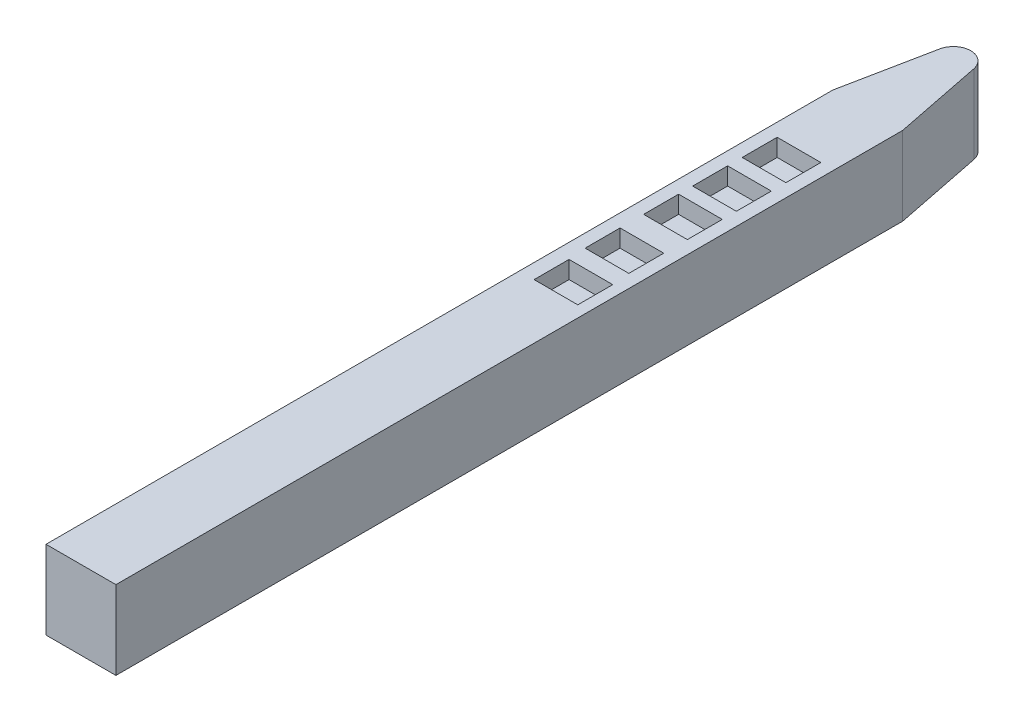
ISO-10303-21;
HEADER;
FILE_DESCRIPTION(('STEP AP214'),'2;1');
FILE_NAME('part.step','',(''),(''),'','','');
FILE_SCHEMA(('AUTOMOTIVE_DESIGN { 1 0 10303 214 1 1 1 1 }'));
ENDSEC;
DATA;
#1=APPLICATION_CONTEXT('core data for automotive mechanical design processes');
#2=APPLICATION_PROTOCOL_DEFINITION('international standard','automotive_design',2000,#1);
#3=PRODUCT_CONTEXT('',#1,'mechanical');
#4=PRODUCT('Part','Part','',(#3));
#5=PRODUCT_RELATED_PRODUCT_CATEGORY('part','',(#4));
#6=PRODUCT_DEFINITION_FORMATION('','',#4);
#7=PRODUCT_DEFINITION_CONTEXT('part definition',#1,'design');
#8=PRODUCT_DEFINITION('design','',#6,#7);
#9=PRODUCT_DEFINITION_SHAPE('','',#8);
#10=(LENGTH_UNIT() NAMED_UNIT(*) SI_UNIT(.MILLI.,.METRE.));
#11=(NAMED_UNIT(*) PLANE_ANGLE_UNIT() SI_UNIT($,.RADIAN.));
#12=(NAMED_UNIT(*) SI_UNIT($,.STERADIAN.) SOLID_ANGLE_UNIT());
#13=UNCERTAINTY_MEASURE_WITH_UNIT(LENGTH_MEASURE(1.E-05),#10,'distance_accuracy_value','');
#14=(GEOMETRIC_REPRESENTATION_CONTEXT(3) GLOBAL_UNCERTAINTY_ASSIGNED_CONTEXT((#13)) GLOBAL_UNIT_ASSIGNED_CONTEXT((#10,
#11,#12)) REPRESENTATION_CONTEXT('',''));
#15=CARTESIAN_POINT('',(0.,0.,0.));
#16=DIRECTION('',(0.,0.,1.));
#17=DIRECTION('',(1.,0.,0.));
#18=AXIS2_PLACEMENT_3D('',#15,#16,#17);
#19=CARTESIAN_POINT('',(0.,114.3,0.));
#20=DIRECTION('',(0.,0.,-1.));
#21=DIRECTION('',(-1.,0.,0.));
#22=AXIS2_PLACEMENT_3D('',#19,#20,#21);
#23=PLANE('',#22);
#24=DIRECTION('',(1.,0.,0.));
#25=VECTOR('',#24,1.);
#26=CARTESIAN_POINT('',(0.,0.,0.));
#27=LINE('',#26,#25);
#28=CARTESIAN_POINT('',(0.,0.,0.));
#29=VERTEX_POINT('',#28);
#30=CARTESIAN_POINT('',(101.6,0.,0.));
#31=VERTEX_POINT('',#30);
#32=EDGE_CURVE('E249',#29,#31,#27,.T.);
#33=ORIENTED_EDGE('',*,*,#32,.T.);
#34=DIRECTION('',(0.,-1.,0.));
#35=VECTOR('',#34,1.);
#36=CARTESIAN_POINT('',(101.6,114.3,0.));
#37=LINE('',#36,#35);
#38=CARTESIAN_POINT('',(101.6,114.3,0.));
#39=VERTEX_POINT('',#38);
#40=EDGE_CURVE('E411',#39,#31,#37,.T.);
#41=ORIENTED_EDGE('',*,*,#40,.F.);
#42=DIRECTION('',(1.,0.,0.));
#43=VECTOR('',#42,1.);
#44=CARTESIAN_POINT('',(0.,114.3,0.));
#45=LINE('',#44,#43);
#46=CARTESIAN_POINT('',(0.,114.3,0.));
#47=VERTEX_POINT('',#46);
#48=EDGE_CURVE('E379',#47,#39,#45,.T.);
#49=ORIENTED_EDGE('',*,*,#48,.F.);
#50=DIRECTION('',(0.,-1.,0.));
#51=VECTOR('',#50,1.);
#52=CARTESIAN_POINT('',(0.,114.3,0.));
#53=LINE('',#52,#51);
#54=EDGE_CURVE('E392',#47,#29,#53,.T.);
#55=ORIENTED_EDGE('',*,*,#54,.T.);
#56=EDGE_LOOP('',(#33,#41,#49,#55));
#57=FACE_BOUND('',#56,.T.);
#58=ADVANCED_FACE('F42',(#57),#23,.F.);
#59=CARTESIAN_POINT('',(101.6,114.3,0.));
#60=DIRECTION('',(-1.,0.,0.));
#61=DIRECTION('',(0.,0.,1.));
#62=AXIS2_PLACEMENT_3D('',#59,#60,#61);
#63=PLANE('',#62);
#64=DIRECTION('',(0.,0.,-1.));
#65=VECTOR('',#64,1.);
#66=CARTESIAN_POINT('',(101.6,0.,0.));
#67=LINE('',#66,#65);
#68=CARTESIAN_POINT('',(101.6,0.,-1143.36154341808));
#69=VERTEX_POINT('',#68);
#70=EDGE_CURVE('E395',#31,#69,#67,.T.);
#71=ORIENTED_EDGE('',*,*,#70,.T.);
#72=DIRECTION('',(0.,-1.,0.));
#73=VECTOR('',#72,1.);
#74=CARTESIAN_POINT('',(101.6,114.3,-1143.36154341808));
#75=LINE('',#74,#73);
#76=CARTESIAN_POINT('',(101.6,114.3,-1143.36154341808));
#77=VERTEX_POINT('',#76);
#78=EDGE_CURVE('E408',#77,#69,#75,.T.);
#79=ORIENTED_EDGE('',*,*,#78,.F.);
#80=DIRECTION('',(0.,0.,-1.));
#81=VECTOR('',#80,1.);
#82=CARTESIAN_POINT('',(101.6,114.3,0.));
#83=LINE('',#82,#81);
#84=EDGE_CURVE('E382',#39,#77,#83,.T.);
#85=ORIENTED_EDGE('',*,*,#84,.F.);
#86=ORIENTED_EDGE('',*,*,#40,.T.);
#87=EDGE_LOOP('',(#71,#79,#85,#86));
#88=FACE_BOUND('',#87,.T.);
#89=ADVANCED_FACE('F446',(#88),#63,.F.);
#90=CARTESIAN_POINT('',(50.8,114.3,-1397.));
#91=DIRECTION('',(-0.980526882287862,0.,0.196384910598663));
#92=DIRECTION('',(0.196384910598663,0.,0.980526882287862));
#93=AXIS2_PLACEMENT_3D('',#90,#91,#92);
#94=PLANE('',#93);
#95=DIRECTION('',(-0.196384910598663,0.,-0.980526882287862));
#96=VECTOR('',#95,1.);
#97=CARTESIAN_POINT('',(50.8,0.,-1397.));
#98=LINE('',#97,#96);
#99=CARTESIAN_POINT('',(75.7053828101117,0.,-1272.65033746971));
#100=VERTEX_POINT('',#99);
#101=EDGE_CURVE('E397',#69,#100,#98,.T.);
#102=ORIENTED_EDGE('',*,*,#101,.T.);
#103=DIRECTION('',(0.,-1.,0.));
#104=VECTOR('',#103,1.);
#105=CARTESIAN_POINT('',(75.7053828101117,114.3,-1272.65033746971));
#106=LINE('',#105,#104);
#107=CARTESIAN_POINT('',(75.7053828101117,114.3,-1272.65033746971));
#108=VERTEX_POINT('',#107);
#109=EDGE_CURVE('E50',#100,#108,#106,.F.);
#110=ORIENTED_EDGE('',*,*,#109,.T.);
#111=DIRECTION('',(-0.196384910598663,0.,-0.980526882287862));
#112=VECTOR('',#111,1.);
#113=CARTESIAN_POINT('',(50.8,114.3,-1397.));
#114=LINE('',#113,#112);
#115=EDGE_CURVE('E385',#77,#108,#114,.T.);
#116=ORIENTED_EDGE('',*,*,#115,.F.);
#117=ORIENTED_EDGE('',*,*,#78,.T.);
#118=EDGE_LOOP('',(#102,#110,#116,#117));
#119=FACE_BOUND('',#118,.T.);
#120=ADVANCED_FACE('F421',(#119),#94,.F.);
#121=CARTESIAN_POINT('',(0.,114.3,-1143.36154341808));
#122=DIRECTION('',(0.980526882287862,0.,0.196384910598663));
#123=DIRECTION('',(0.196384910598663,0.,-0.980526882287862));
#124=AXIS2_PLACEMENT_3D('',#121,#122,#123);
#125=PLANE('',#124);
#126=DIRECTION('',(-0.196384910598663,0.,0.980526882287862));
#127=VECTOR('',#126,1.);
#128=CARTESIAN_POINT('',(0.,114.3,-1143.36154341808));
#129=LINE('',#128,#127);
#130=CARTESIAN_POINT('',(25.8946171898883,114.3,-1272.65033746971));
#131=VERTEX_POINT('',#130);
#132=CARTESIAN_POINT('',(0.,114.3,-1143.36154341808));
#133=VERTEX_POINT('',#132);
#134=EDGE_CURVE('E388',#131,#133,#129,.T.);
#135=ORIENTED_EDGE('',*,*,#134,.F.);
#136=DIRECTION('',(0.,-1.,0.));
#137=VECTOR('',#136,1.);
#138=CARTESIAN_POINT('',(25.8946171898883,114.3,-1272.65033746971));
#139=LINE('',#138,#137);
#140=CARTESIAN_POINT('',(25.8946171898883,0.,-1272.65033746971));
#141=VERTEX_POINT('',#140);
#142=EDGE_CURVE('E414',#131,#141,#139,.T.);
#143=ORIENTED_EDGE('',*,*,#142,.T.);
#144=DIRECTION('',(-0.196384910598663,0.,0.980526882287862));
#145=VECTOR('',#144,1.);
#146=CARTESIAN_POINT('',(0.,0.,-1143.36154341808));
#147=LINE('',#146,#145);
#148=CARTESIAN_POINT('',(0.,0.,-1143.36154341808));
#149=VERTEX_POINT('',#148);
#150=EDGE_CURVE('E400',#141,#149,#147,.T.);
#151=ORIENTED_EDGE('',*,*,#150,.T.);
#152=DIRECTION('',(0.,-1.,0.));
#153=VECTOR('',#152,1.);
#154=CARTESIAN_POINT('',(0.,114.3,-1143.36154341808));
#155=LINE('',#154,#153);
#156=EDGE_CURVE('E405',#133,#149,#155,.T.);
#157=ORIENTED_EDGE('',*,*,#156,.F.);
#158=EDGE_LOOP('',(#135,#143,#151,#157));
#159=FACE_BOUND('',#158,.T.);
#160=ADVANCED_FACE('F432',(#159),#125,.F.);
#161=CARTESIAN_POINT('',(0.,114.3,0.));
#162=DIRECTION('',(1.,0.,0.));
#163=DIRECTION('',(0.,0.,-1.));
#164=AXIS2_PLACEMENT_3D('',#161,#162,#163);
#165=PLANE('',#164);
#166=DIRECTION('',(0.,0.,1.));
#167=VECTOR('',#166,1.);
#168=CARTESIAN_POINT('',(0.,0.,0.));
#169=LINE('',#168,#167);
#170=EDGE_CURVE('E383',#149,#29,#169,.T.);
#171=ORIENTED_EDGE('',*,*,#170,.T.);
#172=ORIENTED_EDGE('',*,*,#54,.F.);
#173=DIRECTION('',(0.,0.,1.));
#174=VECTOR('',#173,1.);
#175=CARTESIAN_POINT('',(0.,114.3,0.));
#176=LINE('',#175,#174);
#177=EDGE_CURVE('E390',#133,#47,#176,.T.);
#178=ORIENTED_EDGE('',*,*,#177,.F.);
#179=ORIENTED_EDGE('',*,*,#156,.T.);
#180=EDGE_LOOP('',(#171,#172,#178,#179));
#181=FACE_BOUND('',#180,.T.);
#182=ADVANCED_FACE('F440',(#181),#165,.F.);
#183=CARTESIAN_POINT('',(0.,114.3,0.));
#184=DIRECTION('',(0.,1.,0.));
#185=DIRECTION('',(0.,0.,1.));
#186=AXIS2_PLACEMENT_3D('',#183,#184,#185);
#187=PLANE('',#186);
#188=DIRECTION('',(0.,0.,-1.));
#189=VECTOR('',#188,1.);
#190=CARTESIAN_POINT('',(82.5500000000001,114.3,-1043.44639649879));
#191=LINE('',#190,#189);
#192=CARTESIAN_POINT('',(82.5500000000001,114.3,-992.646396498789));
#193=VERTEX_POINT('',#192);
#194=CARTESIAN_POINT('',(82.5500000000001,114.3,-1043.44639649879));
#195=VERTEX_POINT('',#194);
#196=EDGE_CURVE('E57',#193,#195,#191,.T.);
#197=ORIENTED_EDGE('',*,*,#196,.F.);
#198=DIRECTION('',(1.,0.,0.));
#199=VECTOR('',#198,1.);
#200=CARTESIAN_POINT('',(19.0500000000001,114.3,-992.646396498789));
#201=LINE('',#200,#199);
#202=CARTESIAN_POINT('',(19.0500000000001,114.3,-992.646396498789));
#203=VERTEX_POINT('',#202);
#204=EDGE_CURVE('E234',#203,#193,#201,.T.);
#205=ORIENTED_EDGE('',*,*,#204,.F.);
#206=DIRECTION('',(0.,0.,1.));
#207=VECTOR('',#206,1.);
#208=CARTESIAN_POINT('',(19.0500000000001,114.3,-1043.44639649879));
#209=LINE('',#208,#207);
#210=CARTESIAN_POINT('',(19.0500000000001,114.3,-1043.44639649879));
#211=VERTEX_POINT('',#210);
#212=EDGE_CURVE('E237',#211,#203,#209,.T.);
#213=ORIENTED_EDGE('',*,*,#212,.F.);
#214=DIRECTION('',(-1.,0.,0.));
#215=VECTOR('',#214,1.);
#216=CARTESIAN_POINT('',(19.0500000000001,114.3,-1043.44639649879));
#217=LINE('',#216,#215);
#218=EDGE_CURVE('E243',#195,#211,#217,.T.);
#219=ORIENTED_EDGE('',*,*,#218,.F.);
#220=EDGE_LOOP('',(#197,#205,#213,#219));
#221=FACE_BOUND('',#220,.T.);
#222=DIRECTION('',(0.,0.,-1.));
#223=VECTOR('',#222,1.);
#224=CARTESIAN_POINT('',(82.55,114.3,-971.474302167176));
#225=LINE('',#224,#223);
#226=CARTESIAN_POINT('',(82.55,114.3,-920.674302167176));
#227=VERTEX_POINT('',#226);
#228=CARTESIAN_POINT('',(82.55,114.3,-971.474302167176));
#229=VERTEX_POINT('',#228);
#230=EDGE_CURVE('E65',#227,#229,#225,.T.);
#231=ORIENTED_EDGE('',*,*,#230,.F.);
#232=DIRECTION('',(1.,0.,0.));
#233=VECTOR('',#232,1.);
#234=CARTESIAN_POINT('',(19.05,114.3,-920.674302167176));
#235=LINE('',#234,#233);
#236=CARTESIAN_POINT('',(19.05,114.3,-920.674302167176));
#237=VERTEX_POINT('',#236);
#238=EDGE_CURVE('E263',#237,#227,#235,.T.);
#239=ORIENTED_EDGE('',*,*,#238,.F.);
#240=DIRECTION('',(0.,0.,1.));
#241=VECTOR('',#240,1.);
#242=CARTESIAN_POINT('',(19.05,114.3,-971.474302167176));
#243=LINE('',#242,#241);
#244=CARTESIAN_POINT('',(19.05,114.3,-971.474302167176));
#245=VERTEX_POINT('',#244);
#246=EDGE_CURVE('E266',#245,#237,#243,.T.);
#247=ORIENTED_EDGE('',*,*,#246,.F.);
#248=DIRECTION('',(-1.,0.,0.));
#249=VECTOR('',#248,1.);
#250=CARTESIAN_POINT('',(19.05,114.3,-971.474302167176));
#251=LINE('',#250,#249);
#252=EDGE_CURVE('E270',#229,#245,#251,.T.);
#253=ORIENTED_EDGE('',*,*,#252,.F.);
#254=EDGE_LOOP('',(#231,#239,#247,#253));
#255=FACE_BOUND('',#254,.T.);
#256=DIRECTION('',(0.,0.,-1.));
#257=VECTOR('',#256,1.);
#258=CARTESIAN_POINT('',(82.55,114.3,-900.222900853417));
#259=LINE('',#258,#257);
#260=CARTESIAN_POINT('',(82.55,114.3,-849.422900853417));
#261=VERTEX_POINT('',#260);
#262=CARTESIAN_POINT('',(82.55,114.3,-900.222900853417));
#263=VERTEX_POINT('',#262);
#264=EDGE_CURVE('E262',#261,#263,#259,.T.);
#265=ORIENTED_EDGE('',*,*,#264,.F.);
#266=DIRECTION('',(1.,0.,0.));
#267=VECTOR('',#266,1.);
#268=CARTESIAN_POINT('',(19.05,114.3,-849.422900853417));
#269=LINE('',#268,#267);
#270=CARTESIAN_POINT('',(19.05,114.3,-849.422900853417));
#271=VERTEX_POINT('',#270);
#272=EDGE_CURVE('E295',#271,#261,#269,.T.);
#273=ORIENTED_EDGE('',*,*,#272,.F.);
#274=DIRECTION('',(0.,0.,1.));
#275=VECTOR('',#274,1.);
#276=CARTESIAN_POINT('',(19.05,114.3,-900.222900853417));
#277=LINE('',#276,#275);
#278=CARTESIAN_POINT('',(19.05,114.3,-900.222900853417));
#279=VERTEX_POINT('',#278);
#280=EDGE_CURVE('E298',#279,#271,#277,.T.);
#281=ORIENTED_EDGE('',*,*,#280,.F.);
#282=DIRECTION('',(-1.,0.,0.));
#283=VECTOR('',#282,1.);
#284=CARTESIAN_POINT('',(19.05,114.3,-900.222900853417));
#285=LINE('',#284,#283);
#286=EDGE_CURVE('E302',#263,#279,#285,.T.);
#287=ORIENTED_EDGE('',*,*,#286,.F.);
#288=EDGE_LOOP('',(#265,#273,#281,#287));
#289=FACE_BOUND('',#288,.T.);
#290=DIRECTION('',(0.,0.,-1.));
#291=VECTOR('',#290,1.);
#292=CARTESIAN_POINT('',(82.55,114.3,-815.181020196798));
#293=LINE('',#292,#291);
#294=CARTESIAN_POINT('',(82.55,114.3,-764.381020196799));
#295=VERTEX_POINT('',#294);
#296=CARTESIAN_POINT('',(82.55,114.3,-815.181020196798));
#297=VERTEX_POINT('',#296);
#298=EDGE_CURVE('E294',#295,#297,#293,.T.);
#299=ORIENTED_EDGE('',*,*,#298,.F.);
#300=DIRECTION('',(1.,0.,0.));
#301=VECTOR('',#300,1.);
#302=CARTESIAN_POINT('',(19.05,114.3,-764.381020196799));
#303=LINE('',#302,#301);
#304=CARTESIAN_POINT('',(19.05,114.3,-764.381020196799));
#305=VERTEX_POINT('',#304);
#306=EDGE_CURVE('E327',#305,#295,#303,.T.);
#307=ORIENTED_EDGE('',*,*,#306,.F.);
#308=DIRECTION('',(0.,0.,1.));
#309=VECTOR('',#308,1.);
#310=CARTESIAN_POINT('',(19.05,114.3,-815.181020196798));
#311=LINE('',#310,#309);
#312=CARTESIAN_POINT('',(19.05,114.3,-815.181020196798));
#313=VERTEX_POINT('',#312);
#314=EDGE_CURVE('E330',#313,#305,#311,.T.);
#315=ORIENTED_EDGE('',*,*,#314,.F.);
#316=DIRECTION('',(-1.,0.,0.));
#317=VECTOR('',#316,1.);
#318=CARTESIAN_POINT('',(19.05,114.3,-815.181020196798));
#319=LINE('',#318,#317);
#320=EDGE_CURVE('E334',#297,#313,#319,.T.);
#321=ORIENTED_EDGE('',*,*,#320,.F.);
#322=EDGE_LOOP('',(#299,#307,#315,#321));
#323=FACE_BOUND('',#322,.T.);
#324=DIRECTION('',(0.,0.,-1.));
#325=VECTOR('',#324,1.);
#326=CARTESIAN_POINT('',(85.0561353854123,114.3,-738.533095908915));
#327=LINE('',#326,#325);
#328=CARTESIAN_POINT('',(85.0561353854123,114.3,-687.733095908915));
#329=VERTEX_POINT('',#328);
#330=CARTESIAN_POINT('',(85.0561353854123,114.3,-738.533095908915));
#331=VERTEX_POINT('',#330);
#332=EDGE_CURVE('E326',#329,#331,#327,.T.);
#333=ORIENTED_EDGE('',*,*,#332,.F.);
#334=DIRECTION('',(1.,0.,0.));
#335=VECTOR('',#334,1.);
#336=CARTESIAN_POINT('',(21.5561353854123,114.3,-687.733095908915));
#337=LINE('',#336,#335);
#338=CARTESIAN_POINT('',(21.5561353854123,114.3,-687.733095908915));
#339=VERTEX_POINT('',#338);
#340=EDGE_CURVE('E358',#339,#329,#337,.T.);
#341=ORIENTED_EDGE('',*,*,#340,.F.);
#342=DIRECTION('',(0.,0.,1.));
#343=VECTOR('',#342,1.);
#344=CARTESIAN_POINT('',(21.5561353854123,114.3,-738.533095908915));
#345=LINE('',#344,#343);
#346=CARTESIAN_POINT('',(21.5561353854123,114.3,-738.533095908915));
#347=VERTEX_POINT('',#346);
#348=EDGE_CURVE('E361',#347,#339,#345,.T.);
#349=ORIENTED_EDGE('',*,*,#348,.F.);
#350=DIRECTION('',(-1.,0.,0.));
#351=VECTOR('',#350,1.);
#352=CARTESIAN_POINT('',(21.5561353854123,114.3,-738.533095908915));
#353=LINE('',#352,#351);
#354=EDGE_CURVE('E365',#331,#347,#353,.T.);
#355=ORIENTED_EDGE('',*,*,#354,.F.);
#356=EDGE_LOOP('',(#333,#341,#349,#355));
#357=FACE_BOUND('',#356,.T.);
#358=ORIENTED_EDGE('',*,*,#115,.T.);
#359=CARTESIAN_POINT('',(50.8,114.3,-1267.66216074051));
#360=DIRECTION('',(0.,1.,0.));
#361=DIRECTION('',(0.,0.,1.));
#362=AXIS2_PLACEMENT_3D('',#359,#360,#361);
#363=CIRCLE('',#362,25.4);
#364=EDGE_CURVE('E11',#108,#131,#363,.T.);
#365=ORIENTED_EDGE('',*,*,#364,.T.);
#366=ORIENTED_EDGE('',*,*,#134,.T.);
#367=ORIENTED_EDGE('',*,*,#177,.T.);
#368=ORIENTED_EDGE('',*,*,#48,.T.);
#369=ORIENTED_EDGE('',*,*,#84,.T.);
#370=EDGE_LOOP('',(#358,#365,#366,#367,#368,#369));
#371=FACE_BOUND('',#370,.T.);
#372=ADVANCED_FACE('F426',(#221,#255,#289,#323,#357,#371),#187,.T.);
#373=CARTESIAN_POINT('',(0.,0.,0.));
#374=DIRECTION('',(0.,1.,0.));
#375=DIRECTION('',(0.,0.,1.));
#376=AXIS2_PLACEMENT_3D('',#373,#374,#375);
#377=PLANE('',#376);
#378=ORIENTED_EDGE('',*,*,#150,.F.);
#379=CARTESIAN_POINT('',(50.8,0.,-1267.66216074051));
#380=DIRECTION('',(0.,1.,0.));
#381=DIRECTION('',(0.,0.,1.));
#382=AXIS2_PLACEMENT_3D('',#379,#380,#381);
#383=CIRCLE('',#382,25.4);
#384=EDGE_CURVE('E417',#141,#100,#383,.F.);
#385=ORIENTED_EDGE('',*,*,#384,.T.);
#386=ORIENTED_EDGE('',*,*,#101,.F.);
#387=ORIENTED_EDGE('',*,*,#70,.F.);
#388=ORIENTED_EDGE('',*,*,#32,.F.);
#389=ORIENTED_EDGE('',*,*,#170,.F.);
#390=EDGE_LOOP('',(#378,#385,#386,#387,#388,#389));
#391=FACE_BOUND('',#390,.T.);
#392=ADVANCED_FACE('F436',(#391),#377,.F.);
#393=CARTESIAN_POINT('',(50.8,114.3,-1267.66216074051));
#394=DIRECTION('',(0.,-1.,0.));
#395=DIRECTION('',(0.,0.,-1.));
#396=AXIS2_PLACEMENT_3D('',#393,#394,#395);
#397=CYLINDRICAL_SURFACE('',#396,25.4);
#398=ORIENTED_EDGE('',*,*,#364,.F.);
#399=ORIENTED_EDGE('',*,*,#109,.F.);
#400=ORIENTED_EDGE('',*,*,#384,.F.);
#401=ORIENTED_EDGE('',*,*,#142,.F.);
#402=EDGE_LOOP('',(#398,#399,#400,#401));
#403=FACE_BOUND('',#402,.T.);
#404=ADVANCED_FACE('F44',(#403),#397,.T.);
#405=CARTESIAN_POINT('',(85.0561353854123,88.9,-738.533095908915));
#406=DIRECTION('',(1.,0.,0.));
#407=DIRECTION('',(0.,0.,-1.));
#408=AXIS2_PLACEMENT_3D('',#405,#406,#407);
#409=PLANE('',#408);
#410=ORIENTED_EDGE('',*,*,#332,.T.);
#411=DIRECTION('',(0.,1.,0.));
#412=VECTOR('',#411,1.);
#413=CARTESIAN_POINT('',(85.0561353854123,88.9,-738.533095908915));
#414=LINE('',#413,#412);
#415=CARTESIAN_POINT('',(85.0561353854123,88.9,-738.533095908915));
#416=VERTEX_POINT('',#415);
#417=EDGE_CURVE('E348',#416,#331,#414,.T.);
#418=ORIENTED_EDGE('',*,*,#417,.F.);
#419=DIRECTION('',(0.,0.,-1.));
#420=VECTOR('',#419,1.);
#421=CARTESIAN_POINT('',(85.0561353854123,88.9,-738.533095908915));
#422=LINE('',#421,#420);
#423=CARTESIAN_POINT('',(85.0561353854123,88.9,-687.733095908915));
#424=VERTEX_POINT('',#423);
#425=EDGE_CURVE('E362',#424,#416,#422,.T.);
#426=ORIENTED_EDGE('',*,*,#425,.F.);
#427=DIRECTION('',(0.,1.,0.));
#428=VECTOR('',#427,1.);
#429=CARTESIAN_POINT('',(85.0561353854123,88.9,-687.733095908915));
#430=LINE('',#429,#428);
#431=EDGE_CURVE('E356',#424,#329,#430,.T.);
#432=ORIENTED_EDGE('',*,*,#431,.T.);
#433=EDGE_LOOP('',(#410,#418,#426,#432));
#434=FACE_BOUND('',#433,.T.);
#435=ADVANCED_FACE('F474',(#434),#409,.F.);
#436=CARTESIAN_POINT('',(21.5561353854123,88.9,-687.733095908915));
#437=DIRECTION('',(0.,0.,1.));
#438=DIRECTION('',(1.,0.,0.));
#439=AXIS2_PLACEMENT_3D('',#436,#437,#438);
#440=PLANE('',#439);
#441=ORIENTED_EDGE('',*,*,#340,.T.);
#442=ORIENTED_EDGE('',*,*,#431,.F.);
#443=DIRECTION('',(1.,0.,0.));
#444=VECTOR('',#443,1.);
#445=CARTESIAN_POINT('',(21.5561353854123,88.9,-687.733095908915));
#446=LINE('',#445,#444);
#447=CARTESIAN_POINT('',(21.5561353854123,88.9,-687.733095908915));
#448=VERTEX_POINT('',#447);
#449=EDGE_CURVE('E351',#448,#424,#446,.T.);
#450=ORIENTED_EDGE('',*,*,#449,.F.);
#451=DIRECTION('',(0.,1.,0.));
#452=VECTOR('',#451,1.);
#453=CARTESIAN_POINT('',(21.5561353854123,88.9,-687.733095908915));
#454=LINE('',#453,#452);
#455=EDGE_CURVE('E354',#448,#339,#454,.T.);
#456=ORIENTED_EDGE('',*,*,#455,.T.);
#457=EDGE_LOOP('',(#441,#442,#450,#456));
#458=FACE_BOUND('',#457,.T.);
#459=ADVANCED_FACE('F470',(#458),#440,.F.);
#460=CARTESIAN_POINT('',(21.5561353854123,88.9,-738.533095908915));
#461=DIRECTION('',(-1.,0.,0.));
#462=DIRECTION('',(0.,0.,1.));
#463=AXIS2_PLACEMENT_3D('',#460,#461,#462);
#464=PLANE('',#463);
#465=ORIENTED_EDGE('',*,*,#348,.T.);
#466=ORIENTED_EDGE('',*,*,#455,.F.);
#467=DIRECTION('',(0.,0.,1.));
#468=VECTOR('',#467,1.);
#469=CARTESIAN_POINT('',(21.5561353854123,88.9,-738.533095908915));
#470=LINE('',#469,#468);
#471=CARTESIAN_POINT('',(21.5561353854123,88.9,-738.533095908915));
#472=VERTEX_POINT('',#471);
#473=EDGE_CURVE('E371',#472,#448,#470,.T.);
#474=ORIENTED_EDGE('',*,*,#473,.F.);
#475=DIRECTION('',(0.,1.,0.));
#476=VECTOR('',#475,1.);
#477=CARTESIAN_POINT('',(21.5561353854123,88.9,-738.533095908915));
#478=LINE('',#477,#476);
#479=EDGE_CURVE('E352',#472,#347,#478,.T.);
#480=ORIENTED_EDGE('',*,*,#479,.T.);
#481=EDGE_LOOP('',(#465,#466,#474,#480));
#482=FACE_BOUND('',#481,.T.);
#483=ADVANCED_FACE('F473',(#482),#464,.F.);
#484=CARTESIAN_POINT('',(21.5561353854123,88.9,-738.533095908915));
#485=DIRECTION('',(0.,0.,-1.));
#486=DIRECTION('',(-1.,0.,0.));
#487=AXIS2_PLACEMENT_3D('',#484,#485,#486);
#488=PLANE('',#487);
#489=ORIENTED_EDGE('',*,*,#354,.T.);
#490=ORIENTED_EDGE('',*,*,#479,.F.);
#491=DIRECTION('',(-1.,0.,0.));
#492=VECTOR('',#491,1.);
#493=CARTESIAN_POINT('',(21.5561353854123,88.9,-738.533095908915));
#494=LINE('',#493,#492);
#495=EDGE_CURVE('E374',#416,#472,#494,.T.);
#496=ORIENTED_EDGE('',*,*,#495,.F.);
#497=ORIENTED_EDGE('',*,*,#417,.T.);
#498=EDGE_LOOP('',(#489,#490,#496,#497));
#499=FACE_BOUND('',#498,.T.);
#500=ADVANCED_FACE('F468',(#499),#488,.F.);
#501=CARTESIAN_POINT('',(0.,88.9,0.));
#502=DIRECTION('',(0.,1.,0.));
#503=DIRECTION('',(0.,0.,1.));
#504=AXIS2_PLACEMENT_3D('',#501,#502,#503);
#505=PLANE('',#504);
#506=ORIENTED_EDGE('',*,*,#425,.T.);
#507=ORIENTED_EDGE('',*,*,#495,.T.);
#508=ORIENTED_EDGE('',*,*,#473,.T.);
#509=ORIENTED_EDGE('',*,*,#449,.T.);
#510=EDGE_LOOP('',(#506,#507,#508,#509));
#511=FACE_BOUND('',#510,.T.);
#512=ADVANCED_FACE('F464',(#511),#505,.T.);
#513=CARTESIAN_POINT('',(82.55,88.9,-815.181020196798));
#514=DIRECTION('',(1.,0.,0.));
#515=DIRECTION('',(0.,0.,-1.));
#516=AXIS2_PLACEMENT_3D('',#513,#514,#515);
#517=PLANE('',#516);
#518=ORIENTED_EDGE('',*,*,#298,.T.);
#519=DIRECTION('',(0.,1.,0.));
#520=VECTOR('',#519,1.);
#521=CARTESIAN_POINT('',(82.55,88.9,-815.181020196798));
#522=LINE('',#521,#520);
#523=CARTESIAN_POINT('',(82.55,88.9,-815.181020196798));
#524=VERTEX_POINT('',#523);
#525=EDGE_CURVE('E316',#524,#297,#522,.T.);
#526=ORIENTED_EDGE('',*,*,#525,.F.);
#527=DIRECTION('',(0.,0.,-1.));
#528=VECTOR('',#527,1.);
#529=CARTESIAN_POINT('',(82.55,88.9,-815.181020196798));
#530=LINE('',#529,#528);
#531=CARTESIAN_POINT('',(82.55,88.9,-764.381020196799));
#532=VERTEX_POINT('',#531);
#533=EDGE_CURVE('E331',#532,#524,#530,.T.);
#534=ORIENTED_EDGE('',*,*,#533,.F.);
#535=DIRECTION('',(0.,1.,0.));
#536=VECTOR('',#535,1.);
#537=CARTESIAN_POINT('',(82.55,88.9,-764.381020196799));
#538=LINE('',#537,#536);
#539=EDGE_CURVE('E324',#532,#295,#538,.T.);
#540=ORIENTED_EDGE('',*,*,#539,.T.);
#541=EDGE_LOOP('',(#518,#526,#534,#540));
#542=FACE_BOUND('',#541,.T.);
#543=ADVANCED_FACE('F467',(#542),#517,.F.);
#544=CARTESIAN_POINT('',(19.05,88.9,-764.381020196799));
#545=DIRECTION('',(0.,0.,1.));
#546=DIRECTION('',(1.,0.,0.));
#547=AXIS2_PLACEMENT_3D('',#544,#545,#546);
#548=PLANE('',#547);
#549=ORIENTED_EDGE('',*,*,#306,.T.);
#550=ORIENTED_EDGE('',*,*,#539,.F.);
#551=DIRECTION('',(1.,0.,0.));
#552=VECTOR('',#551,1.);
#553=CARTESIAN_POINT('',(19.05,88.9,-764.381020196799));
#554=LINE('',#553,#552);
#555=CARTESIAN_POINT('',(19.05,88.9,-764.381020196799));
#556=VERTEX_POINT('',#555);
#557=EDGE_CURVE('E319',#556,#532,#554,.T.);
#558=ORIENTED_EDGE('',*,*,#557,.F.);
#559=DIRECTION('',(0.,1.,0.));
#560=VECTOR('',#559,1.);
#561=CARTESIAN_POINT('',(19.05,88.9,-764.381020196799));
#562=LINE('',#561,#560);
#563=EDGE_CURVE('E322',#556,#305,#562,.T.);
#564=ORIENTED_EDGE('',*,*,#563,.T.);
#565=EDGE_LOOP('',(#549,#550,#558,#564));
#566=FACE_BOUND('',#565,.T.);
#567=ADVANCED_FACE('F491',(#566),#548,.F.);
#568=CARTESIAN_POINT('',(19.05,88.9,-815.181020196798));
#569=DIRECTION('',(-1.,0.,0.));
#570=DIRECTION('',(0.,0.,1.));
#571=AXIS2_PLACEMENT_3D('',#568,#569,#570);
#572=PLANE('',#571);
#573=ORIENTED_EDGE('',*,*,#314,.T.);
#574=ORIENTED_EDGE('',*,*,#563,.F.);
#575=DIRECTION('',(0.,0.,1.));
#576=VECTOR('',#575,1.);
#577=CARTESIAN_POINT('',(19.05,88.9,-815.181020196798));
#578=LINE('',#577,#576);
#579=CARTESIAN_POINT('',(19.05,88.9,-815.181020196798));
#580=VERTEX_POINT('',#579);
#581=EDGE_CURVE('E340',#580,#556,#578,.T.);
#582=ORIENTED_EDGE('',*,*,#581,.F.);
#583=DIRECTION('',(0.,1.,0.));
#584=VECTOR('',#583,1.);
#585=CARTESIAN_POINT('',(19.05,88.9,-815.181020196798));
#586=LINE('',#585,#584);
#587=EDGE_CURVE('E320',#580,#313,#586,.T.);
#588=ORIENTED_EDGE('',*,*,#587,.T.);
#589=EDGE_LOOP('',(#573,#574,#582,#588));
#590=FACE_BOUND('',#589,.T.);
#591=ADVANCED_FACE('F494',(#590),#572,.F.);
#592=CARTESIAN_POINT('',(19.05,88.9,-815.181020196798));
#593=DIRECTION('',(0.,0.,-1.));
#594=DIRECTION('',(-1.,0.,0.));
#595=AXIS2_PLACEMENT_3D('',#592,#593,#594);
#596=PLANE('',#595);
#597=ORIENTED_EDGE('',*,*,#320,.T.);
#598=ORIENTED_EDGE('',*,*,#587,.F.);
#599=DIRECTION('',(-1.,0.,0.));
#600=VECTOR('',#599,1.);
#601=CARTESIAN_POINT('',(19.05,88.9,-815.181020196798));
#602=LINE('',#601,#600);
#603=EDGE_CURVE('E343',#524,#580,#602,.T.);
#604=ORIENTED_EDGE('',*,*,#603,.F.);
#605=ORIENTED_EDGE('',*,*,#525,.T.);
#606=EDGE_LOOP('',(#597,#598,#604,#605));
#607=FACE_BOUND('',#606,.T.);
#608=ADVANCED_FACE('F489',(#607),#596,.F.);
#609=CARTESIAN_POINT('',(0.,88.9,0.));
#610=DIRECTION('',(0.,1.,0.));
#611=DIRECTION('',(0.,0.,1.));
#612=AXIS2_PLACEMENT_3D('',#609,#610,#611);
#613=PLANE('',#612);
#614=ORIENTED_EDGE('',*,*,#533,.T.);
#615=ORIENTED_EDGE('',*,*,#603,.T.);
#616=ORIENTED_EDGE('',*,*,#581,.T.);
#617=ORIENTED_EDGE('',*,*,#557,.T.);
#618=EDGE_LOOP('',(#614,#615,#616,#617));
#619=FACE_BOUND('',#618,.T.);
#620=ADVANCED_FACE('F485',(#619),#613,.T.);
#621=CARTESIAN_POINT('',(82.55,88.9,-900.222900853417));
#622=DIRECTION('',(1.,0.,0.));
#623=DIRECTION('',(0.,0.,-1.));
#624=AXIS2_PLACEMENT_3D('',#621,#622,#623);
#625=PLANE('',#624);
#626=ORIENTED_EDGE('',*,*,#264,.T.);
#627=DIRECTION('',(0.,1.,0.));
#628=VECTOR('',#627,1.);
#629=CARTESIAN_POINT('',(82.55,88.9,-900.222900853417));
#630=LINE('',#629,#628);
#631=CARTESIAN_POINT('',(82.55,88.9,-900.222900853417));
#632=VERTEX_POINT('',#631);
#633=EDGE_CURVE('E284',#632,#263,#630,.T.);
#634=ORIENTED_EDGE('',*,*,#633,.F.);
#635=DIRECTION('',(0.,0.,-1.));
#636=VECTOR('',#635,1.);
#637=CARTESIAN_POINT('',(82.55,88.9,-900.222900853417));
#638=LINE('',#637,#636);
#639=CARTESIAN_POINT('',(82.55,88.9,-849.422900853417));
#640=VERTEX_POINT('',#639);
#641=EDGE_CURVE('E299',#640,#632,#638,.T.);
#642=ORIENTED_EDGE('',*,*,#641,.F.);
#643=DIRECTION('',(0.,1.,0.));
#644=VECTOR('',#643,1.);
#645=CARTESIAN_POINT('',(82.55,88.9,-849.422900853417));
#646=LINE('',#645,#644);
#647=EDGE_CURVE('E292',#640,#261,#646,.T.);
#648=ORIENTED_EDGE('',*,*,#647,.T.);
#649=EDGE_LOOP('',(#626,#634,#642,#648));
#650=FACE_BOUND('',#649,.T.);
#651=ADVANCED_FACE('F488',(#650),#625,.F.);
#652=CARTESIAN_POINT('',(19.05,88.9,-849.422900853417));
#653=DIRECTION('',(0.,0.,1.));
#654=DIRECTION('',(1.,0.,0.));
#655=AXIS2_PLACEMENT_3D('',#652,#653,#654);
#656=PLANE('',#655);
#657=ORIENTED_EDGE('',*,*,#272,.T.);
#658=ORIENTED_EDGE('',*,*,#647,.F.);
#659=DIRECTION('',(1.,0.,0.));
#660=VECTOR('',#659,1.);
#661=CARTESIAN_POINT('',(19.05,88.9,-849.422900853417));
#662=LINE('',#661,#660);
#663=CARTESIAN_POINT('',(19.05,88.9,-849.422900853417));
#664=VERTEX_POINT('',#663);
#665=EDGE_CURVE('E287',#664,#640,#662,.T.);
#666=ORIENTED_EDGE('',*,*,#665,.F.);
#667=DIRECTION('',(0.,1.,0.));
#668=VECTOR('',#667,1.);
#669=CARTESIAN_POINT('',(19.05,88.9,-849.422900853417));
#670=LINE('',#669,#668);
#671=EDGE_CURVE('E290',#664,#271,#670,.T.);
#672=ORIENTED_EDGE('',*,*,#671,.T.);
#673=EDGE_LOOP('',(#657,#658,#666,#672));
#674=FACE_BOUND('',#673,.T.);
#675=ADVANCED_FACE('F511',(#674),#656,.F.);
#676=CARTESIAN_POINT('',(19.05,88.9,-900.222900853417));
#677=DIRECTION('',(-1.,0.,0.));
#678=DIRECTION('',(0.,0.,1.));
#679=AXIS2_PLACEMENT_3D('',#676,#677,#678);
#680=PLANE('',#679);
#681=ORIENTED_EDGE('',*,*,#280,.T.);
#682=ORIENTED_EDGE('',*,*,#671,.F.);
#683=DIRECTION('',(0.,0.,1.));
#684=VECTOR('',#683,1.);
#685=CARTESIAN_POINT('',(19.05,88.9,-900.222900853417));
#686=LINE('',#685,#684);
#687=CARTESIAN_POINT('',(19.05,88.9,-900.222900853417));
#688=VERTEX_POINT('',#687);
#689=EDGE_CURVE('E308',#688,#664,#686,.T.);
#690=ORIENTED_EDGE('',*,*,#689,.F.);
#691=DIRECTION('',(0.,1.,0.));
#692=VECTOR('',#691,1.);
#693=CARTESIAN_POINT('',(19.05,88.9,-900.222900853417));
#694=LINE('',#693,#692);
#695=EDGE_CURVE('E288',#688,#279,#694,.T.);
#696=ORIENTED_EDGE('',*,*,#695,.T.);
#697=EDGE_LOOP('',(#681,#682,#690,#696));
#698=FACE_BOUND('',#697,.T.);
#699=ADVANCED_FACE('F514',(#698),#680,.F.);
#700=CARTESIAN_POINT('',(19.05,88.9,-900.222900853417));
#701=DIRECTION('',(0.,0.,-1.));
#702=DIRECTION('',(-1.,0.,0.));
#703=AXIS2_PLACEMENT_3D('',#700,#701,#702);
#704=PLANE('',#703);
#705=ORIENTED_EDGE('',*,*,#286,.T.);
#706=ORIENTED_EDGE('',*,*,#695,.F.);
#707=DIRECTION('',(-1.,0.,0.));
#708=VECTOR('',#707,1.);
#709=CARTESIAN_POINT('',(19.05,88.9,-900.222900853417));
#710=LINE('',#709,#708);
#711=EDGE_CURVE('E311',#632,#688,#710,.T.);
#712=ORIENTED_EDGE('',*,*,#711,.F.);
#713=ORIENTED_EDGE('',*,*,#633,.T.);
#714=EDGE_LOOP('',(#705,#706,#712,#713));
#715=FACE_BOUND('',#714,.T.);
#716=ADVANCED_FACE('F509',(#715),#704,.F.);
#717=CARTESIAN_POINT('',(0.,88.9,0.));
#718=DIRECTION('',(0.,1.,0.));
#719=DIRECTION('',(0.,0.,1.));
#720=AXIS2_PLACEMENT_3D('',#717,#718,#719);
#721=PLANE('',#720);
#722=ORIENTED_EDGE('',*,*,#641,.T.);
#723=ORIENTED_EDGE('',*,*,#711,.T.);
#724=ORIENTED_EDGE('',*,*,#689,.T.);
#725=ORIENTED_EDGE('',*,*,#665,.T.);
#726=EDGE_LOOP('',(#722,#723,#724,#725));
#727=FACE_BOUND('',#726,.T.);
#728=ADVANCED_FACE('F505',(#727),#721,.T.);
#729=CARTESIAN_POINT('',(82.55,88.9,-971.474302167176));
#730=DIRECTION('',(1.,0.,0.));
#731=DIRECTION('',(0.,0.,-1.));
#732=AXIS2_PLACEMENT_3D('',#729,#730,#731);
#733=PLANE('',#732);
#734=ORIENTED_EDGE('',*,*,#230,.T.);
#735=DIRECTION('',(0.,1.,0.));
#736=VECTOR('',#735,1.);
#737=CARTESIAN_POINT('',(82.55,88.9,-971.474302167176));
#738=LINE('',#737,#736);
#739=CARTESIAN_POINT('',(82.55,88.9,-971.474302167176));
#740=VERTEX_POINT('',#739);
#741=EDGE_CURVE('E253',#740,#229,#738,.T.);
#742=ORIENTED_EDGE('',*,*,#741,.F.);
#743=DIRECTION('',(0.,0.,-1.));
#744=VECTOR('',#743,1.);
#745=CARTESIAN_POINT('',(82.55,88.9,-971.474302167176));
#746=LINE('',#745,#744);
#747=CARTESIAN_POINT('',(82.55,88.9,-920.674302167176));
#748=VERTEX_POINT('',#747);
#749=EDGE_CURVE('E267',#748,#740,#746,.T.);
#750=ORIENTED_EDGE('',*,*,#749,.F.);
#751=DIRECTION('',(0.,1.,0.));
#752=VECTOR('',#751,1.);
#753=CARTESIAN_POINT('',(82.55,88.9,-920.674302167176));
#754=LINE('',#753,#752);
#755=EDGE_CURVE('E260',#748,#227,#754,.T.);
#756=ORIENTED_EDGE('',*,*,#755,.T.);
#757=EDGE_LOOP('',(#734,#742,#750,#756));
#758=FACE_BOUND('',#757,.T.);
#759=ADVANCED_FACE('F508',(#758),#733,.F.);
#760=CARTESIAN_POINT('',(19.05,88.9,-920.674302167176));
#761=DIRECTION('',(0.,0.,1.));
#762=DIRECTION('',(1.,0.,0.));
#763=AXIS2_PLACEMENT_3D('',#760,#761,#762);
#764=PLANE('',#763);
#765=ORIENTED_EDGE('',*,*,#238,.T.);
#766=ORIENTED_EDGE('',*,*,#755,.F.);
#767=DIRECTION('',(1.,0.,0.));
#768=VECTOR('',#767,1.);
#769=CARTESIAN_POINT('',(19.05,88.9,-920.674302167176));
#770=LINE('',#769,#768);
#771=CARTESIAN_POINT('',(19.05,88.9,-920.674302167176));
#772=VERTEX_POINT('',#771);
#773=EDGE_CURVE('E255',#772,#748,#770,.T.);
#774=ORIENTED_EDGE('',*,*,#773,.F.);
#775=DIRECTION('',(0.,1.,0.));
#776=VECTOR('',#775,1.);
#777=CARTESIAN_POINT('',(19.05,88.9,-920.674302167176));
#778=LINE('',#777,#776);
#779=EDGE_CURVE('E258',#772,#237,#778,.T.);
#780=ORIENTED_EDGE('',*,*,#779,.T.);
#781=EDGE_LOOP('',(#765,#766,#774,#780));
#782=FACE_BOUND('',#781,.T.);
#783=ADVANCED_FACE('F530',(#782),#764,.F.);
#784=CARTESIAN_POINT('',(19.05,88.9,-971.474302167176));
#785=DIRECTION('',(-1.,0.,0.));
#786=DIRECTION('',(0.,0.,1.));
#787=AXIS2_PLACEMENT_3D('',#784,#785,#786);
#788=PLANE('',#787);
#789=ORIENTED_EDGE('',*,*,#246,.T.);
#790=ORIENTED_EDGE('',*,*,#779,.F.);
#791=DIRECTION('',(0.,0.,1.));
#792=VECTOR('',#791,1.);
#793=CARTESIAN_POINT('',(19.05,88.9,-971.474302167176));
#794=LINE('',#793,#792);
#795=CARTESIAN_POINT('',(19.05,88.9,-971.474302167176));
#796=VERTEX_POINT('',#795);
#797=EDGE_CURVE('E276',#796,#772,#794,.T.);
#798=ORIENTED_EDGE('',*,*,#797,.F.);
#799=DIRECTION('',(0.,1.,0.));
#800=VECTOR('',#799,1.);
#801=CARTESIAN_POINT('',(19.05,88.9,-971.474302167176));
#802=LINE('',#801,#800);
#803=EDGE_CURVE('E256',#796,#245,#802,.T.);
#804=ORIENTED_EDGE('',*,*,#803,.T.);
#805=EDGE_LOOP('',(#789,#790,#798,#804));
#806=FACE_BOUND('',#805,.T.);
#807=ADVANCED_FACE('F533',(#806),#788,.F.);
#808=CARTESIAN_POINT('',(19.05,88.9,-971.474302167176));
#809=DIRECTION('',(0.,0.,-1.));
#810=DIRECTION('',(-1.,0.,0.));
#811=AXIS2_PLACEMENT_3D('',#808,#809,#810);
#812=PLANE('',#811);
#813=ORIENTED_EDGE('',*,*,#252,.T.);
#814=ORIENTED_EDGE('',*,*,#803,.F.);
#815=DIRECTION('',(-1.,0.,0.));
#816=VECTOR('',#815,1.);
#817=CARTESIAN_POINT('',(19.05,88.9,-971.474302167176));
#818=LINE('',#817,#816);
#819=EDGE_CURVE('E279',#740,#796,#818,.T.);
#820=ORIENTED_EDGE('',*,*,#819,.F.);
#821=ORIENTED_EDGE('',*,*,#741,.T.);
#822=EDGE_LOOP('',(#813,#814,#820,#821));
#823=FACE_BOUND('',#822,.T.);
#824=ADVANCED_FACE('F528',(#823),#812,.F.);
#825=CARTESIAN_POINT('',(0.,88.9,0.));
#826=DIRECTION('',(0.,1.,0.));
#827=DIRECTION('',(0.,0.,1.));
#828=AXIS2_PLACEMENT_3D('',#825,#826,#827);
#829=PLANE('',#828);
#830=ORIENTED_EDGE('',*,*,#749,.T.);
#831=ORIENTED_EDGE('',*,*,#819,.T.);
#832=ORIENTED_EDGE('',*,*,#797,.T.);
#833=ORIENTED_EDGE('',*,*,#773,.T.);
#834=EDGE_LOOP('',(#830,#831,#832,#833));
#835=FACE_BOUND('',#834,.T.);
#836=ADVANCED_FACE('F525',(#835),#829,.T.);
#837=CARTESIAN_POINT('',(82.5500000000001,88.9,-1043.44639649879));
#838=DIRECTION('',(1.,0.,0.));
#839=DIRECTION('',(0.,0.,-1.));
#840=AXIS2_PLACEMENT_3D('',#837,#838,#839);
#841=PLANE('',#840);
#842=ORIENTED_EDGE('',*,*,#196,.T.);
#843=DIRECTION('',(0.,1.,0.));
#844=VECTOR('',#843,1.);
#845=CARTESIAN_POINT('',(82.5500000000001,88.9,-1043.44639649879));
#846=LINE('',#845,#844);
#847=CARTESIAN_POINT('',(82.5500000000001,88.9,-1043.44639649879));
#848=VERTEX_POINT('',#847);
#849=EDGE_CURVE('E212',#848,#195,#846,.T.);
#850=ORIENTED_EDGE('',*,*,#849,.F.);
#851=DIRECTION('',(0.,0.,-1.));
#852=VECTOR('',#851,1.);
#853=CARTESIAN_POINT('',(82.5500000000001,88.9,-1043.44639649879));
#854=LINE('',#853,#852);
#855=CARTESIAN_POINT('',(82.5500000000001,88.9,-992.646396498789));
#856=VERTEX_POINT('',#855);
#857=EDGE_CURVE('E216',#856,#848,#854,.T.);
#858=ORIENTED_EDGE('',*,*,#857,.F.);
#859=DIRECTION('',(0.,1.,0.));
#860=VECTOR('',#859,1.);
#861=CARTESIAN_POINT('',(82.5500000000001,88.9,-992.646396498789));
#862=LINE('',#861,#860);
#863=EDGE_CURVE('E247',#856,#193,#862,.T.);
#864=ORIENTED_EDGE('',*,*,#863,.T.);
#865=EDGE_LOOP('',(#842,#850,#858,#864));
#866=FACE_BOUND('',#865,.T.);
#867=ADVANCED_FACE('F214',(#866),#841,.F.);
#868=CARTESIAN_POINT('',(19.0500000000001,88.9,-992.646396498789));
#869=DIRECTION('',(0.,0.,1.));
#870=DIRECTION('',(1.,0.,0.));
#871=AXIS2_PLACEMENT_3D('',#868,#869,#870);
#872=PLANE('',#871);
#873=ORIENTED_EDGE('',*,*,#204,.T.);
#874=ORIENTED_EDGE('',*,*,#863,.F.);
#875=DIRECTION('',(1.,0.,0.));
#876=VECTOR('',#875,1.);
#877=CARTESIAN_POINT('',(19.0500000000001,88.9,-992.646396498789));
#878=LINE('',#877,#876);
#879=CARTESIAN_POINT('',(19.0500000000001,88.9,-992.646396498789));
#880=VERTEX_POINT('',#879);
#881=EDGE_CURVE('E222',#880,#856,#878,.T.);
#882=ORIENTED_EDGE('',*,*,#881,.F.);
#883=DIRECTION('',(0.,1.,0.));
#884=VECTOR('',#883,1.);
#885=CARTESIAN_POINT('',(19.0500000000001,88.9,-992.646396498789));
#886=LINE('',#885,#884);
#887=EDGE_CURVE('E250',#880,#203,#886,.T.);
#888=ORIENTED_EDGE('',*,*,#887,.T.);
#889=EDGE_LOOP('',(#873,#874,#882,#888));
#890=FACE_BOUND('',#889,.T.);
#891=ADVANCED_FACE('F545',(#890),#872,.F.);
#892=CARTESIAN_POINT('',(19.0500000000001,88.9,-1043.44639649879));
#893=DIRECTION('',(-1.,0.,0.));
#894=DIRECTION('',(0.,0.,1.));
#895=AXIS2_PLACEMENT_3D('',#892,#893,#894);
#896=PLANE('',#895);
#897=ORIENTED_EDGE('',*,*,#212,.T.);
#898=ORIENTED_EDGE('',*,*,#887,.F.);
#899=DIRECTION('',(0.,0.,1.));
#900=VECTOR('',#899,1.);
#901=CARTESIAN_POINT('',(19.0500000000001,88.9,-1043.44639649879));
#902=LINE('',#901,#900);
#903=CARTESIAN_POINT('',(19.0500000000001,88.9,-1043.44639649879));
#904=VERTEX_POINT('',#903);
#905=EDGE_CURVE('E230',#904,#880,#902,.T.);
#906=ORIENTED_EDGE('',*,*,#905,.F.);
#907=DIRECTION('',(0.,1.,0.));
#908=VECTOR('',#907,1.);
#909=CARTESIAN_POINT('',(19.0500000000001,88.9,-1043.44639649879));
#910=LINE('',#909,#908);
#911=EDGE_CURVE('E221',#904,#211,#910,.T.);
#912=ORIENTED_EDGE('',*,*,#911,.T.);
#913=EDGE_LOOP('',(#897,#898,#906,#912));
#914=FACE_BOUND('',#913,.T.);
#915=ADVANCED_FACE('F548',(#914),#896,.F.);
#916=CARTESIAN_POINT('',(19.0500000000001,88.9,-1043.44639649879));
#917=DIRECTION('',(0.,0.,-1.));
#918=DIRECTION('',(-1.,0.,0.));
#919=AXIS2_PLACEMENT_3D('',#916,#917,#918);
#920=PLANE('',#919);
#921=ORIENTED_EDGE('',*,*,#218,.T.);
#922=ORIENTED_EDGE('',*,*,#911,.F.);
#923=DIRECTION('',(-1.,0.,0.));
#924=VECTOR('',#923,1.);
#925=CARTESIAN_POINT('',(19.0500000000001,88.9,-1043.44639649879));
#926=LINE('',#925,#924);
#927=EDGE_CURVE('E225',#848,#904,#926,.T.);
#928=ORIENTED_EDGE('',*,*,#927,.F.);
#929=ORIENTED_EDGE('',*,*,#849,.T.);
#930=EDGE_LOOP('',(#921,#922,#928,#929));
#931=FACE_BOUND('',#930,.T.);
#932=ADVANCED_FACE('F226',(#931),#920,.F.);
#933=CARTESIAN_POINT('',(0.,88.9,0.));
#934=DIRECTION('',(0.,1.,0.));
#935=DIRECTION('',(0.,0.,1.));
#936=AXIS2_PLACEMENT_3D('',#933,#934,#935);
#937=PLANE('',#936);
#938=ORIENTED_EDGE('',*,*,#857,.T.);
#939=ORIENTED_EDGE('',*,*,#927,.T.);
#940=ORIENTED_EDGE('',*,*,#905,.T.);
#941=ORIENTED_EDGE('',*,*,#881,.T.);
#942=EDGE_LOOP('',(#938,#939,#940,#941));
#943=FACE_BOUND('',#942,.T.);
#944=ADVANCED_FACE('F232',(#943),#937,.T.);
#945=CLOSED_SHELL('',(#58,#89,#120,#160,#182,#372,#392,#404,#435,#459,#483,#500,#512,#543,#567,
#591,#608,#620,#651,#675,#699,#716,#728,#759,#783,#807,#824,#836,#867,#891,#915,#932,#944));
#946=MANIFOLD_SOLID_BREP('B2',#945);
#947=ADVANCED_BREP_SHAPE_REPRESENTATION('',(#18,#946),#14);
#948=SHAPE_DEFINITION_REPRESENTATION(#9,#947);
ENDSEC;
END-ISO-10303-21;
